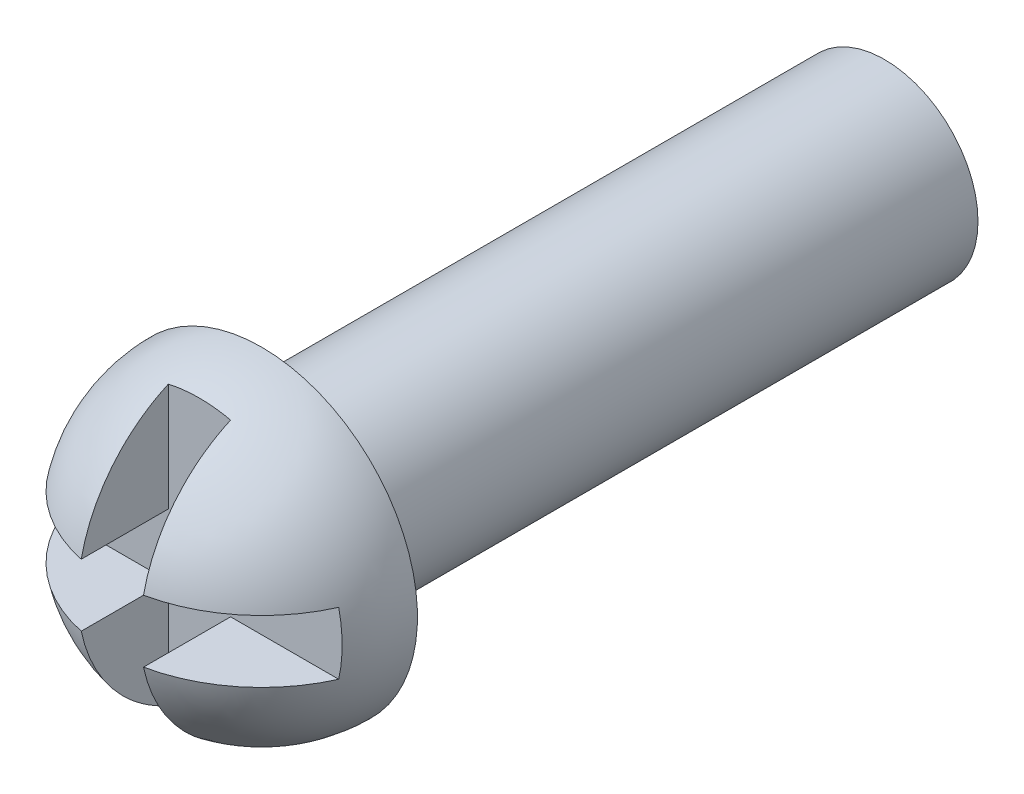
ISO-10303-21;
HEADER;
FILE_DESCRIPTION(('STEP AP214'),'2;1');
FILE_NAME('part.step','',(''),(''),'','','');
FILE_SCHEMA(('AUTOMOTIVE_DESIGN { 1 0 10303 214 1 1 1 1 }'));
ENDSEC;
DATA;
#1=APPLICATION_CONTEXT('core data for automotive mechanical design processes');
#2=APPLICATION_PROTOCOL_DEFINITION('international standard','automotive_design',2000,#1);
#3=PRODUCT_CONTEXT('',#1,'mechanical');
#4=PRODUCT('Part','Part','',(#3));
#5=PRODUCT_RELATED_PRODUCT_CATEGORY('part','',(#4));
#6=PRODUCT_DEFINITION_FORMATION('','',#4);
#7=PRODUCT_DEFINITION_CONTEXT('part definition',#1,'design');
#8=PRODUCT_DEFINITION('design','',#6,#7);
#9=PRODUCT_DEFINITION_SHAPE('','',#8);
#10=(LENGTH_UNIT() NAMED_UNIT(*) SI_UNIT(.MILLI.,.METRE.));
#11=(NAMED_UNIT(*) PLANE_ANGLE_UNIT() SI_UNIT($,.RADIAN.));
#12=(NAMED_UNIT(*) SI_UNIT($,.STERADIAN.) SOLID_ANGLE_UNIT());
#13=UNCERTAINTY_MEASURE_WITH_UNIT(LENGTH_MEASURE(1.E-05),#10,'distance_accuracy_value','');
#14=(GEOMETRIC_REPRESENTATION_CONTEXT(3) GLOBAL_UNCERTAINTY_ASSIGNED_CONTEXT((#13)) GLOBAL_UNIT_ASSIGNED_CONTEXT((#10,
#11,#12)) REPRESENTATION_CONTEXT('',''));
#15=CARTESIAN_POINT('',(0.,0.,0.));
#16=DIRECTION('',(0.,0.,1.));
#17=DIRECTION('',(1.,0.,0.));
#18=AXIS2_PLACEMENT_3D('',#15,#16,#17);
#19=CARTESIAN_POINT('',(0.,0.,10.));
#20=DIRECTION('',(0.,0.,-1.));
#21=DIRECTION('',(-1.,0.,0.));
#22=AXIS2_PLACEMENT_3D('',#19,#20,#21);
#23=CYLINDRICAL_SURFACE('',#22,1.5);
#24=CARTESIAN_POINT('',(0.,0.,10.));
#25=DIRECTION('',(0.,0.,1.));
#26=DIRECTION('',(1.,0.,0.));
#27=AXIS2_PLACEMENT_3D('',#24,#25,#26);
#28=CIRCLE('',#27,1.5);
#29=CARTESIAN_POINT('',(1.5,0.,10.));
#30=VERTEX_POINT('',#29);
#31=EDGE_CURVE('E162',#30,#30,#28,.T.);
#32=ORIENTED_EDGE('',*,*,#31,.F.);
#33=EDGE_LOOP('',(#32));
#34=FACE_BOUND('',#33,.T.);
#35=CARTESIAN_POINT('',(0.,0.,0.));
#36=DIRECTION('',(0.,0.,1.));
#37=DIRECTION('',(1.,0.,0.));
#38=AXIS2_PLACEMENT_3D('',#35,#36,#37);
#39=CIRCLE('',#38,1.5);
#40=CARTESIAN_POINT('',(1.5,0.,0.));
#41=VERTEX_POINT('',#40);
#42=EDGE_CURVE('E161',#41,#41,#39,.T.);
#43=ORIENTED_EDGE('',*,*,#42,.T.);
#44=EDGE_LOOP('',(#43));
#45=FACE_BOUND('',#44,.T.);
#46=ADVANCED_FACE('F39',(#34,#45),#23,.T.);
#47=CARTESIAN_POINT('',(0.,0.,0.));
#48=DIRECTION('',(0.,0.,1.));
#49=DIRECTION('',(1.,0.,0.));
#50=AXIS2_PLACEMENT_3D('',#47,#48,#49);
#51=PLANE('',#50);
#52=ORIENTED_EDGE('',*,*,#42,.F.);
#53=EDGE_LOOP('',(#52));
#54=FACE_BOUND('',#53,.T.);
#55=ADVANCED_FACE('F222',(#54),#51,.F.);
#56=CARTESIAN_POINT('',(0.,0.,10.));
#57=DIRECTION('',(0.,1.,0.));
#58=DIRECTION('',(-1.,0.,0.));
#59=AXIS2_PLACEMENT_3D('',#56,#57,#58);
#60=SPHERICAL_SURFACE('',#59,2.5);
#61=CARTESIAN_POINT('',(0.,0.,11.));
#62=DIRECTION('',(0.,0.,1.));
#63=DIRECTION('',(1.,0.,0.));
#64=AXIS2_PLACEMENT_3D('',#61,#62,#63);
#65=CIRCLE('',#64,2.29128784747792);
#66=CARTESIAN_POINT('',(-0.5,-2.23606797749979,11.));
#67=VERTEX_POINT('',#66);
#68=CARTESIAN_POINT('',(0.5,-2.23606797749979,11.));
#69=VERTEX_POINT('',#68);
#70=EDGE_CURVE('E194',#67,#69,#65,.T.);
#71=ORIENTED_EDGE('',*,*,#70,.F.);
#72=CARTESIAN_POINT('',(-0.5,0.,10.));
#73=DIRECTION('',(-1.,0.,0.));
#74=DIRECTION('',(0.,-1.,0.));
#75=AXIS2_PLACEMENT_3D('',#72,#73,#74);
#76=CIRCLE('',#75,2.44948974278318);
#77=CARTESIAN_POINT('',(-0.5,-0.5,12.3979157616564));
#78=VERTEX_POINT('',#77);
#79=EDGE_CURVE('E11',#67,#78,#76,.T.);
#80=ORIENTED_EDGE('',*,*,#79,.T.);
#81=CARTESIAN_POINT('',(0.,-0.5,10.));
#82=DIRECTION('',(0.,-1.,0.));
#83=DIRECTION('',(0.,0.,-1.));
#84=AXIS2_PLACEMENT_3D('',#81,#82,#83);
#85=CIRCLE('',#84,2.44948974278318);
#86=CARTESIAN_POINT('',(-2.23606797749979,-0.5,11.));
#87=VERTEX_POINT('',#86);
#88=EDGE_CURVE('E47',#78,#87,#85,.T.);
#89=ORIENTED_EDGE('',*,*,#88,.T.);
#90=CARTESIAN_POINT('',(-2.23606797749979,0.5,11.));
#91=VERTEX_POINT('',#90);
#92=EDGE_CURVE('E113',#91,#87,#65,.T.);
#93=ORIENTED_EDGE('',*,*,#92,.F.);
#94=CARTESIAN_POINT('',(0.,0.5,10.));
#95=DIRECTION('',(0.,1.,0.));
#96=DIRECTION('',(0.,0.,1.));
#97=AXIS2_PLACEMENT_3D('',#94,#95,#96);
#98=CIRCLE('',#97,2.44948974278318);
#99=CARTESIAN_POINT('',(-0.5,0.5,12.3979157616564));
#100=VERTEX_POINT('',#99);
#101=EDGE_CURVE('E191',#91,#100,#98,.T.);
#102=ORIENTED_EDGE('',*,*,#101,.T.);
#103=CARTESIAN_POINT('',(-0.5,0.,10.));
#104=DIRECTION('',(-1.,0.,0.));
#105=DIRECTION('',(0.,-1.,0.));
#106=AXIS2_PLACEMENT_3D('',#103,#104,#105);
#107=CIRCLE('',#106,2.44948974278318);
#108=CARTESIAN_POINT('',(-0.5,2.23606797749979,11.));
#109=VERTEX_POINT('',#108);
#110=EDGE_CURVE('E62',#100,#109,#107,.T.);
#111=ORIENTED_EDGE('',*,*,#110,.T.);
#112=CARTESIAN_POINT('',(0.5,2.23606797749979,11.));
#113=VERTEX_POINT('',#112);
#114=EDGE_CURVE('E173',#113,#109,#65,.T.);
#115=ORIENTED_EDGE('',*,*,#114,.F.);
#116=CARTESIAN_POINT('',(0.5,0.,10.));
#117=DIRECTION('',(1.,0.,0.));
#118=DIRECTION('',(0.,1.,0.));
#119=AXIS2_PLACEMENT_3D('',#116,#117,#118);
#120=CIRCLE('',#119,2.44948974278318);
#121=CARTESIAN_POINT('',(0.5,0.5,12.3979157616564));
#122=VERTEX_POINT('',#121);
#123=EDGE_CURVE('E181',#113,#122,#120,.T.);
#124=ORIENTED_EDGE('',*,*,#123,.T.);
#125=CARTESIAN_POINT('',(0.,0.5,10.));
#126=DIRECTION('',(0.,1.,0.));
#127=DIRECTION('',(0.,0.,1.));
#128=AXIS2_PLACEMENT_3D('',#125,#126,#127);
#129=CIRCLE('',#128,2.44948974278318);
#130=CARTESIAN_POINT('',(2.23606797749979,0.5,11.));
#131=VERTEX_POINT('',#130);
#132=EDGE_CURVE('E177',#122,#131,#129,.T.);
#133=ORIENTED_EDGE('',*,*,#132,.T.);
#134=CARTESIAN_POINT('',(2.23606797749979,-0.5,11.));
#135=VERTEX_POINT('',#134);
#136=EDGE_CURVE('E166',#135,#131,#65,.T.);
#137=ORIENTED_EDGE('',*,*,#136,.F.);
#138=CARTESIAN_POINT('',(0.,-0.5,10.));
#139=DIRECTION('',(0.,-1.,0.));
#140=DIRECTION('',(0.,0.,-1.));
#141=AXIS2_PLACEMENT_3D('',#138,#139,#140);
#142=CIRCLE('',#141,2.44948974278318);
#143=CARTESIAN_POINT('',(0.5,-0.5,12.3979157616564));
#144=VERTEX_POINT('',#143);
#145=EDGE_CURVE('E172',#135,#144,#142,.T.);
#146=ORIENTED_EDGE('',*,*,#145,.T.);
#147=CARTESIAN_POINT('',(0.5,0.,10.));
#148=DIRECTION('',(1.,0.,0.));
#149=DIRECTION('',(0.,1.,0.));
#150=AXIS2_PLACEMENT_3D('',#147,#148,#149);
#151=CIRCLE('',#150,2.44948974278318);
#152=EDGE_CURVE('E185',#144,#69,#151,.T.);
#153=ORIENTED_EDGE('',*,*,#152,.T.);
#154=EDGE_LOOP('',(#71,#80,#89,#93,#102,#111,#115,#124,#133,#137,#146,#153));
#155=FACE_BOUND('',#154,.T.);
#156=CARTESIAN_POINT('',(0.,0.,10.));
#157=DIRECTION('',(0.,0.,-1.));
#158=DIRECTION('',(-1.,0.,0.));
#159=AXIS2_PLACEMENT_3D('',#156,#157,#158);
#160=CIRCLE('',#159,2.5);
#161=CARTESIAN_POINT('',(-2.5,0.,9.99999999999998));
#162=VERTEX_POINT('',#161);
#163=EDGE_CURVE('E150',#162,#162,#160,.T.);
#164=ORIENTED_EDGE('',*,*,#163,.F.);
#165=EDGE_LOOP('',(#164));
#166=FACE_BOUND('',#165,.T.);
#167=ADVANCED_FACE('F205',(#155,#166),#60,.T.);
#168=CARTESIAN_POINT('',(0.,0.,10.));
#169=DIRECTION('',(0.,0.,-1.));
#170=DIRECTION('',(-1.,0.,0.));
#171=AXIS2_PLACEMENT_3D('',#168,#169,#170);
#172=PLANE('',#171);
#173=ORIENTED_EDGE('',*,*,#31,.T.);
#174=EDGE_LOOP('',(#173));
#175=FACE_BOUND('',#174,.T.);
#176=ORIENTED_EDGE('',*,*,#163,.T.);
#177=EDGE_LOOP('',(#176));
#178=FACE_BOUND('',#177,.T.);
#179=ADVANCED_FACE('F210',(#175,#178),#172,.T.);
#180=CARTESIAN_POINT('',(-3.,0.5,11.));
#181=DIRECTION('',(0.,1.,0.));
#182=DIRECTION('',(0.,0.,1.));
#183=AXIS2_PLACEMENT_3D('',#180,#181,#182);
#184=PLANE('',#183);
#185=DIRECTION('',(-1.,0.,0.));
#186=VECTOR('',#185,1.);
#187=CARTESIAN_POINT('',(-3.,0.5,11.));
#188=LINE('',#187,#186);
#189=CARTESIAN_POINT('',(-0.5,0.5,11.));
#190=VERTEX_POINT('',#189);
#191=EDGE_CURVE('E124',#190,#91,#188,.T.);
#192=ORIENTED_EDGE('',*,*,#191,.F.);
#193=DIRECTION('',(0.,0.,1.));
#194=VECTOR('',#193,1.);
#195=CARTESIAN_POINT('',(-0.5,0.5,11.));
#196=LINE('',#195,#194);
#197=EDGE_CURVE('E147',#190,#100,#196,.T.);
#198=ORIENTED_EDGE('',*,*,#197,.T.);
#199=ORIENTED_EDGE('',*,*,#101,.F.);
#200=EDGE_LOOP('',(#192,#198,#199));
#201=FACE_BOUND('',#200,.T.);
#202=ADVANCED_FACE('F208',(#201),#184,.F.);
#203=CARTESIAN_POINT('',(-0.5,2.92937917855284,11.));
#204=DIRECTION('',(-1.,0.,0.));
#205=DIRECTION('',(0.,-1.,0.));
#206=AXIS2_PLACEMENT_3D('',#203,#204,#205);
#207=PLANE('',#206);
#208=ORIENTED_EDGE('',*,*,#197,.F.);
#209=DIRECTION('',(0.,-1.,0.));
#210=VECTOR('',#209,1.);
#211=CARTESIAN_POINT('',(-0.5,2.92937917855284,11.));
#212=LINE('',#211,#210);
#213=EDGE_CURVE('E142',#109,#190,#212,.T.);
#214=ORIENTED_EDGE('',*,*,#213,.F.);
#215=ORIENTED_EDGE('',*,*,#110,.F.);
#216=EDGE_LOOP('',(#208,#214,#215));
#217=FACE_BOUND('',#216,.T.);
#218=ADVANCED_FACE('F203',(#217),#207,.F.);
#219=CARTESIAN_POINT('',(0.5,2.92937917855284,11.));
#220=DIRECTION('',(1.,0.,0.));
#221=DIRECTION('',(0.,1.,0.));
#222=AXIS2_PLACEMENT_3D('',#219,#220,#221);
#223=PLANE('',#222);
#224=DIRECTION('',(0.,1.,0.));
#225=VECTOR('',#224,1.);
#226=CARTESIAN_POINT('',(0.5,2.92937917855284,11.));
#227=LINE('',#226,#225);
#228=CARTESIAN_POINT('',(0.5,0.5,11.));
#229=VERTEX_POINT('',#228);
#230=EDGE_CURVE('E138',#229,#113,#227,.T.);
#231=ORIENTED_EDGE('',*,*,#230,.F.);
#232=DIRECTION('',(0.,0.,1.));
#233=VECTOR('',#232,1.);
#234=CARTESIAN_POINT('',(0.5,0.5,11.));
#235=LINE('',#234,#233);
#236=EDGE_CURVE('E151',#229,#122,#235,.T.);
#237=ORIENTED_EDGE('',*,*,#236,.T.);
#238=ORIENTED_EDGE('',*,*,#123,.F.);
#239=EDGE_LOOP('',(#231,#237,#238));
#240=FACE_BOUND('',#239,.T.);
#241=ADVANCED_FACE('F216',(#240),#223,.F.);
#242=CARTESIAN_POINT('',(0.5,0.5,11.));
#243=DIRECTION('',(0.,1.,0.));
#244=DIRECTION('',(0.,0.,1.));
#245=AXIS2_PLACEMENT_3D('',#242,#243,#244);
#246=PLANE('',#245);
#247=ORIENTED_EDGE('',*,*,#236,.F.);
#248=DIRECTION('',(-1.,0.,0.));
#249=VECTOR('',#248,1.);
#250=CARTESIAN_POINT('',(0.5,0.5,11.));
#251=LINE('',#250,#249);
#252=EDGE_CURVE('E135',#131,#229,#251,.T.);
#253=ORIENTED_EDGE('',*,*,#252,.F.);
#254=ORIENTED_EDGE('',*,*,#132,.F.);
#255=EDGE_LOOP('',(#247,#253,#254));
#256=FACE_BOUND('',#255,.T.);
#257=ADVANCED_FACE('F249',(#256),#246,.F.);
#258=CARTESIAN_POINT('',(0.5,-0.5,11.));
#259=DIRECTION('',(0.,-1.,0.));
#260=DIRECTION('',(0.,0.,-1.));
#261=AXIS2_PLACEMENT_3D('',#258,#259,#260);
#262=PLANE('',#261);
#263=DIRECTION('',(1.,0.,0.));
#264=VECTOR('',#263,1.);
#265=CARTESIAN_POINT('',(0.5,-0.5,11.));
#266=LINE('',#265,#264);
#267=CARTESIAN_POINT('',(0.5,-0.5,11.));
#268=VERTEX_POINT('',#267);
#269=EDGE_CURVE('E54',#268,#135,#266,.T.);
#270=ORIENTED_EDGE('',*,*,#269,.F.);
#271=DIRECTION('',(0.,0.,1.));
#272=VECTOR('',#271,1.);
#273=CARTESIAN_POINT('',(0.5,-0.5,11.));
#274=LINE('',#273,#272);
#275=EDGE_CURVE('E123',#268,#144,#274,.T.);
#276=ORIENTED_EDGE('',*,*,#275,.T.);
#277=ORIENTED_EDGE('',*,*,#145,.F.);
#278=EDGE_LOOP('',(#270,#276,#277));
#279=FACE_BOUND('',#278,.T.);
#280=ADVANCED_FACE('F245',(#279),#262,.F.);
#281=CARTESIAN_POINT('',(0.5,-0.5,11.));
#282=DIRECTION('',(1.,0.,0.));
#283=DIRECTION('',(0.,1.,0.));
#284=AXIS2_PLACEMENT_3D('',#281,#282,#283);
#285=PLANE('',#284);
#286=ORIENTED_EDGE('',*,*,#275,.F.);
#287=DIRECTION('',(0.,1.,0.));
#288=VECTOR('',#287,1.);
#289=CARTESIAN_POINT('',(0.5,-0.5,11.));
#290=LINE('',#289,#288);
#291=EDGE_CURVE('E128',#69,#268,#290,.T.);
#292=ORIENTED_EDGE('',*,*,#291,.F.);
#293=ORIENTED_EDGE('',*,*,#152,.F.);
#294=EDGE_LOOP('',(#286,#292,#293));
#295=FACE_BOUND('',#294,.T.);
#296=ADVANCED_FACE('F242',(#295),#285,.F.);
#297=CARTESIAN_POINT('',(-0.5,-0.5,11.));
#298=DIRECTION('',(-1.,0.,0.));
#299=DIRECTION('',(0.,-1.,0.));
#300=AXIS2_PLACEMENT_3D('',#297,#298,#299);
#301=PLANE('',#300);
#302=DIRECTION('',(0.,-1.,0.));
#303=VECTOR('',#302,1.);
#304=CARTESIAN_POINT('',(-0.5,-0.5,11.));
#305=LINE('',#304,#303);
#306=CARTESIAN_POINT('',(-0.5,-0.5,11.));
#307=VERTEX_POINT('',#306);
#308=EDGE_CURVE('E109',#307,#67,#305,.T.);
#309=ORIENTED_EDGE('',*,*,#308,.F.);
#310=DIRECTION('',(0.,0.,1.));
#311=VECTOR('',#310,1.);
#312=CARTESIAN_POINT('',(-0.5,-0.5,11.));
#313=LINE('',#312,#311);
#314=EDGE_CURVE('E119',#307,#78,#313,.T.);
#315=ORIENTED_EDGE('',*,*,#314,.T.);
#316=ORIENTED_EDGE('',*,*,#79,.F.);
#317=EDGE_LOOP('',(#309,#315,#316));
#318=FACE_BOUND('',#317,.T.);
#319=ADVANCED_FACE('F126',(#318),#301,.F.);
#320=CARTESIAN_POINT('',(-3.,-0.5,11.));
#321=DIRECTION('',(0.,-1.,0.));
#322=DIRECTION('',(0.,0.,-1.));
#323=AXIS2_PLACEMENT_3D('',#320,#321,#322);
#324=PLANE('',#323);
#325=ORIENTED_EDGE('',*,*,#314,.F.);
#326=DIRECTION('',(1.,0.,0.));
#327=VECTOR('',#326,1.);
#328=CARTESIAN_POINT('',(-3.,-0.5,11.));
#329=LINE('',#328,#327);
#330=EDGE_CURVE('E105',#87,#307,#329,.T.);
#331=ORIENTED_EDGE('',*,*,#330,.F.);
#332=ORIENTED_EDGE('',*,*,#88,.F.);
#333=EDGE_LOOP('',(#325,#331,#332));
#334=FACE_BOUND('',#333,.T.);
#335=ADVANCED_FACE('F120',(#334),#324,.F.);
#336=CARTESIAN_POINT('',(0.,0.,11.));
#337=DIRECTION('',(0.,0.,1.));
#338=DIRECTION('',(1.,0.,0.));
#339=AXIS2_PLACEMENT_3D('',#336,#337,#338);
#340=PLANE('',#339);
#341=ORIENTED_EDGE('',*,*,#114,.T.);
#342=ORIENTED_EDGE('',*,*,#213,.T.);
#343=ORIENTED_EDGE('',*,*,#191,.T.);
#344=ORIENTED_EDGE('',*,*,#92,.T.);
#345=ORIENTED_EDGE('',*,*,#330,.T.);
#346=ORIENTED_EDGE('',*,*,#308,.T.);
#347=ORIENTED_EDGE('',*,*,#70,.T.);
#348=ORIENTED_EDGE('',*,*,#291,.T.);
#349=ORIENTED_EDGE('',*,*,#269,.T.);
#350=ORIENTED_EDGE('',*,*,#136,.T.);
#351=ORIENTED_EDGE('',*,*,#252,.T.);
#352=ORIENTED_EDGE('',*,*,#230,.T.);
#353=EDGE_LOOP('',(#341,#342,#343,#344,#345,#346,#347,#348,#349,#350,#351,#352));
#354=FACE_BOUND('',#353,.T.);
#355=ADVANCED_FACE('F107',(#354),#340,.T.);
#356=CLOSED_SHELL('',(#46,#55,#167,#179,#202,#218,#241,#257,#280,#296,#319,#335,#355));
#357=MANIFOLD_SOLID_BREP('B2',#356);
#358=ADVANCED_BREP_SHAPE_REPRESENTATION('',(#18,#357),#14);
#359=SHAPE_DEFINITION_REPRESENTATION(#9,#358);
ENDSEC;
END-ISO-10303-21;
